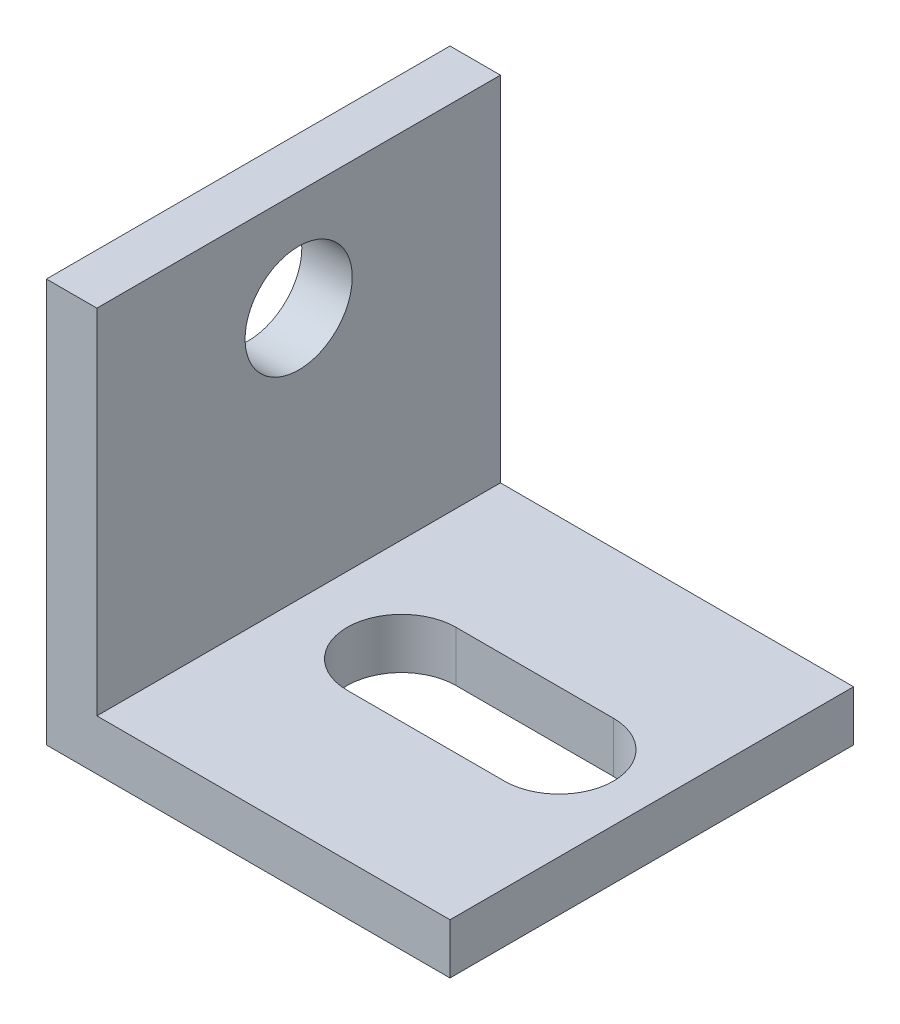
ISO-10303-21;
HEADER;
FILE_DESCRIPTION(('STEP AP214'),'2;1');
FILE_NAME('part.step','',(''),(''),'','','');
FILE_SCHEMA(('AUTOMOTIVE_DESIGN { 1 0 10303 214 1 1 1 1 }'));
ENDSEC;
DATA;
#1=APPLICATION_CONTEXT('core data for automotive mechanical design processes');
#2=APPLICATION_PROTOCOL_DEFINITION('international standard','automotive_design',2000,#1);
#3=PRODUCT_CONTEXT('',#1,'mechanical');
#4=PRODUCT('Part','Part','',(#3));
#5=PRODUCT_RELATED_PRODUCT_CATEGORY('part','',(#4));
#6=PRODUCT_DEFINITION_FORMATION('','',#4);
#7=PRODUCT_DEFINITION_CONTEXT('part definition',#1,'design');
#8=PRODUCT_DEFINITION('design','',#6,#7);
#9=PRODUCT_DEFINITION_SHAPE('','',#8);
#10=(LENGTH_UNIT() NAMED_UNIT(*) SI_UNIT(.MILLI.,.METRE.));
#11=(NAMED_UNIT(*) PLANE_ANGLE_UNIT() SI_UNIT($,.RADIAN.));
#12=(NAMED_UNIT(*) SI_UNIT($,.STERADIAN.) SOLID_ANGLE_UNIT());
#13=UNCERTAINTY_MEASURE_WITH_UNIT(LENGTH_MEASURE(1.E-05),#10,'distance_accuracy_value','');
#14=(GEOMETRIC_REPRESENTATION_CONTEXT(3) GLOBAL_UNCERTAINTY_ASSIGNED_CONTEXT((#13)) GLOBAL_UNIT_ASSIGNED_CONTEXT((#10,
#11,#12)) REPRESENTATION_CONTEXT('',''));
#15=CARTESIAN_POINT('',(0.,0.,0.));
#16=DIRECTION('',(0.,0.,1.));
#17=DIRECTION('',(1.,0.,0.));
#18=AXIS2_PLACEMENT_3D('',#15,#16,#17);
#19=CARTESIAN_POINT('',(0.,0.,25.4));
#20=DIRECTION('',(0.,1.,0.));
#21=DIRECTION('',(0.,0.,1.));
#22=AXIS2_PLACEMENT_3D('',#19,#20,#21);
#23=PLANE('',#22);
#24=DIRECTION('',(-1.,0.,0.));
#25=VECTOR('',#24,1.);
#26=CARTESIAN_POINT('',(0.,0.,9.271));
#27=LINE('',#26,#25);
#28=CARTESIAN_POINT('',(19.558,0.,9.271));
#29=VERTEX_POINT('',#28);
#30=CARTESIAN_POINT('',(9.652,0.,9.271));
#31=VERTEX_POINT('',#30);
#32=EDGE_CURVE('E144',#29,#31,#27,.T.);
#33=ORIENTED_EDGE('',*,*,#32,.T.);
#34=CARTESIAN_POINT('',(9.652,0.,12.7));
#35=DIRECTION('',(0.,1.,0.));
#36=DIRECTION('',(0.,0.,1.));
#37=AXIS2_PLACEMENT_3D('',#34,#35,#36);
#38=CIRCLE('',#37,3.429);
#39=CARTESIAN_POINT('',(9.652,0.,16.129));
#40=VERTEX_POINT('',#39);
#41=EDGE_CURVE('E147',#31,#40,#38,.T.);
#42=ORIENTED_EDGE('',*,*,#41,.T.);
#43=DIRECTION('',(1.,0.,0.));
#44=VECTOR('',#43,1.);
#45=CARTESIAN_POINT('',(0.,0.,16.129));
#46=LINE('',#45,#44);
#47=CARTESIAN_POINT('',(19.558,0.,16.129));
#48=VERTEX_POINT('',#47);
#49=EDGE_CURVE('E139',#40,#48,#46,.T.);
#50=ORIENTED_EDGE('',*,*,#49,.T.);
#51=CARTESIAN_POINT('',(19.558,0.,12.7));
#52=DIRECTION('',(0.,1.,0.));
#53=DIRECTION('',(0.,0.,1.));
#54=AXIS2_PLACEMENT_3D('',#51,#52,#53);
#55=CIRCLE('',#54,3.429);
#56=EDGE_CURVE('E119',#48,#29,#55,.T.);
#57=ORIENTED_EDGE('',*,*,#56,.T.);
#58=EDGE_LOOP('',(#33,#42,#50,#57));
#59=FACE_BOUND('',#58,.T.);
#60=DIRECTION('',(1.,0.,0.));
#61=VECTOR('',#60,1.);
#62=CARTESIAN_POINT('',(0.,0.,0.));
#63=LINE('',#62,#61);
#64=CARTESIAN_POINT('',(0.,0.,0.));
#65=VERTEX_POINT('',#64);
#66=CARTESIAN_POINT('',(25.4,0.,0.));
#67=VERTEX_POINT('',#66);
#68=EDGE_CURVE('E150',#65,#67,#63,.T.);
#69=ORIENTED_EDGE('',*,*,#68,.T.);
#70=DIRECTION('',(0.,0.,-1.));
#71=VECTOR('',#70,1.);
#72=CARTESIAN_POINT('',(25.4,0.,25.4));
#73=LINE('',#72,#71);
#74=CARTESIAN_POINT('',(25.4,0.,25.4));
#75=VERTEX_POINT('',#74);
#76=EDGE_CURVE('E11',#75,#67,#73,.T.);
#77=ORIENTED_EDGE('',*,*,#76,.F.);
#78=DIRECTION('',(1.,0.,0.));
#79=VECTOR('',#78,1.);
#80=CARTESIAN_POINT('',(0.,0.,25.4));
#81=LINE('',#80,#79);
#82=CARTESIAN_POINT('',(0.,0.,25.4));
#83=VERTEX_POINT('',#82);
#84=EDGE_CURVE('E151',#83,#75,#81,.T.);
#85=ORIENTED_EDGE('',*,*,#84,.F.);
#86=DIRECTION('',(0.,0.,-1.));
#87=VECTOR('',#86,1.);
#88=CARTESIAN_POINT('',(0.,0.,25.4));
#89=LINE('',#88,#87);
#90=EDGE_CURVE('E165',#83,#65,#89,.T.);
#91=ORIENTED_EDGE('',*,*,#90,.T.);
#92=EDGE_LOOP('',(#69,#77,#85,#91));
#93=FACE_BOUND('',#92,.T.);
#94=ADVANCED_FACE('F36',(#59,#93),#23,.F.);
#95=CARTESIAN_POINT('',(25.4,3.175,25.4));
#96=DIRECTION('',(-1.,0.,0.));
#97=DIRECTION('',(0.,0.,1.));
#98=AXIS2_PLACEMENT_3D('',#95,#96,#97);
#99=PLANE('',#98);
#100=DIRECTION('',(0.,1.,0.));
#101=VECTOR('',#100,1.);
#102=CARTESIAN_POINT('',(25.4,3.175,0.));
#103=LINE('',#102,#101);
#104=CARTESIAN_POINT('',(25.4,3.175,0.));
#105=VERTEX_POINT('',#104);
#106=EDGE_CURVE('E168',#67,#105,#103,.T.);
#107=ORIENTED_EDGE('',*,*,#106,.T.);
#108=DIRECTION('',(0.,0.,-1.));
#109=VECTOR('',#108,1.);
#110=CARTESIAN_POINT('',(25.4,3.175,25.4));
#111=LINE('',#110,#109);
#112=CARTESIAN_POINT('',(25.4,3.175,25.4));
#113=VERTEX_POINT('',#112);
#114=EDGE_CURVE('E44',#113,#105,#111,.T.);
#115=ORIENTED_EDGE('',*,*,#114,.F.);
#116=DIRECTION('',(0.,1.,0.));
#117=VECTOR('',#116,1.);
#118=CARTESIAN_POINT('',(25.4,3.175,25.4));
#119=LINE('',#118,#117);
#120=EDGE_CURVE('E154',#75,#113,#119,.T.);
#121=ORIENTED_EDGE('',*,*,#120,.F.);
#122=ORIENTED_EDGE('',*,*,#76,.T.);
#123=EDGE_LOOP('',(#107,#115,#121,#122));
#124=FACE_BOUND('',#123,.T.);
#125=ADVANCED_FACE('F214',(#124),#99,.F.);
#126=CARTESIAN_POINT('',(3.175,3.175,25.4));
#127=DIRECTION('',(0.,-1.,0.));
#128=DIRECTION('',(0.,0.,-1.));
#129=AXIS2_PLACEMENT_3D('',#126,#127,#128);
#130=PLANE('',#129);
#131=DIRECTION('',(1.,0.,0.));
#132=VECTOR('',#131,1.);
#133=CARTESIAN_POINT('',(9.652,3.175,16.129));
#134=LINE('',#133,#132);
#135=CARTESIAN_POINT('',(9.652,3.175,16.129));
#136=VERTEX_POINT('',#135);
#137=CARTESIAN_POINT('',(19.558,3.175,16.129));
#138=VERTEX_POINT('',#137);
#139=EDGE_CURVE('E125',#136,#138,#134,.T.);
#140=ORIENTED_EDGE('',*,*,#139,.F.);
#141=CARTESIAN_POINT('',(9.652,3.175,12.7));
#142=DIRECTION('',(0.,1.,0.));
#143=DIRECTION('',(0.,0.,1.));
#144=AXIS2_PLACEMENT_3D('',#141,#142,#143);
#145=CIRCLE('',#144,3.429);
#146=CARTESIAN_POINT('',(9.652,3.175,9.271));
#147=VERTEX_POINT('',#146);
#148=EDGE_CURVE('E59',#147,#136,#145,.T.);
#149=ORIENTED_EDGE('',*,*,#148,.F.);
#150=DIRECTION('',(-1.,0.,0.));
#151=VECTOR('',#150,1.);
#152=CARTESIAN_POINT('',(9.652,3.175,9.271));
#153=LINE('',#152,#151);
#154=CARTESIAN_POINT('',(19.558,3.175,9.271));
#155=VERTEX_POINT('',#154);
#156=EDGE_CURVE('E132',#155,#147,#153,.T.);
#157=ORIENTED_EDGE('',*,*,#156,.F.);
#158=CARTESIAN_POINT('',(19.558,3.175,12.7));
#159=DIRECTION('',(0.,1.,0.));
#160=DIRECTION('',(0.,0.,1.));
#161=AXIS2_PLACEMENT_3D('',#158,#159,#160);
#162=CIRCLE('',#161,3.429);
#163=EDGE_CURVE('E116',#138,#155,#162,.T.);
#164=ORIENTED_EDGE('',*,*,#163,.F.);
#165=EDGE_LOOP('',(#140,#149,#157,#164));
#166=FACE_BOUND('',#165,.T.);
#167=DIRECTION('',(-1.,0.,0.));
#168=VECTOR('',#167,1.);
#169=CARTESIAN_POINT('',(3.175,3.175,0.));
#170=LINE('',#169,#168);
#171=CARTESIAN_POINT('',(3.175,3.175,0.));
#172=VERTEX_POINT('',#171);
#173=EDGE_CURVE('E170',#105,#172,#170,.T.);
#174=ORIENTED_EDGE('',*,*,#173,.T.);
#175=DIRECTION('',(0.,0.,-1.));
#176=VECTOR('',#175,1.);
#177=CARTESIAN_POINT('',(3.175,3.175,25.4));
#178=LINE('',#177,#176);
#179=CARTESIAN_POINT('',(3.175,3.175,25.4));
#180=VERTEX_POINT('',#179);
#181=EDGE_CURVE('E185',#180,#172,#178,.T.);
#182=ORIENTED_EDGE('',*,*,#181,.F.);
#183=DIRECTION('',(-1.,0.,0.));
#184=VECTOR('',#183,1.);
#185=CARTESIAN_POINT('',(3.175,3.175,25.4));
#186=LINE('',#185,#184);
#187=EDGE_CURVE('E157',#113,#180,#186,.T.);
#188=ORIENTED_EDGE('',*,*,#187,.F.);
#189=ORIENTED_EDGE('',*,*,#114,.T.);
#190=EDGE_LOOP('',(#174,#182,#188,#189));
#191=FACE_BOUND('',#190,.T.);
#192=ADVANCED_FACE('F129',(#166,#191),#130,.F.);
#193=CARTESIAN_POINT('',(3.175,25.4,25.4));
#194=DIRECTION('',(-1.,0.,0.));
#195=DIRECTION('',(0.,-1.,0.));
#196=AXIS2_PLACEMENT_3D('',#193,#194,#195);
#197=PLANE('',#196);
#198=CARTESIAN_POINT('',(3.175,19.05,12.7));
#199=DIRECTION('',(1.,0.,0.));
#200=DIRECTION('',(0.,1.,0.));
#201=AXIS2_PLACEMENT_3D('',#198,#199,#200);
#202=CIRCLE('',#201,3.3734375);
#203=CARTESIAN_POINT('',(3.175,22.4234375,12.7));
#204=VERTEX_POINT('',#203);
#205=EDGE_CURVE('E258',#204,#204,#202,.T.);
#206=ORIENTED_EDGE('',*,*,#205,.F.);
#207=EDGE_LOOP('',(#206));
#208=FACE_BOUND('',#207,.T.);
#209=DIRECTION('',(0.,1.,0.));
#210=VECTOR('',#209,1.);
#211=CARTESIAN_POINT('',(3.175,25.4,0.));
#212=LINE('',#211,#210);
#213=CARTESIAN_POINT('',(3.175,25.4,0.));
#214=VERTEX_POINT('',#213);
#215=EDGE_CURVE('E172',#172,#214,#212,.T.);
#216=ORIENTED_EDGE('',*,*,#215,.T.);
#217=DIRECTION('',(0.,0.,-1.));
#218=VECTOR('',#217,1.);
#219=CARTESIAN_POINT('',(3.175,25.4,25.4));
#220=LINE('',#219,#218);
#221=CARTESIAN_POINT('',(3.175,25.4,25.4));
#222=VERTEX_POINT('',#221);
#223=EDGE_CURVE('E182',#222,#214,#220,.T.);
#224=ORIENTED_EDGE('',*,*,#223,.F.);
#225=DIRECTION('',(0.,1.,0.));
#226=VECTOR('',#225,1.);
#227=CARTESIAN_POINT('',(3.175,25.4,25.4));
#228=LINE('',#227,#226);
#229=EDGE_CURVE('E159',#180,#222,#228,.T.);
#230=ORIENTED_EDGE('',*,*,#229,.F.);
#231=ORIENTED_EDGE('',*,*,#181,.T.);
#232=EDGE_LOOP('',(#216,#224,#230,#231));
#233=FACE_BOUND('',#232,.T.);
#234=ADVANCED_FACE('F202',(#208,#233),#197,.F.);
#235=CARTESIAN_POINT('',(0.,25.4,25.4));
#236=DIRECTION('',(0.,-1.,0.));
#237=DIRECTION('',(0.,0.,-1.));
#238=AXIS2_PLACEMENT_3D('',#235,#236,#237);
#239=PLANE('',#238);
#240=DIRECTION('',(-1.,0.,0.));
#241=VECTOR('',#240,1.);
#242=CARTESIAN_POINT('',(0.,25.4,0.));
#243=LINE('',#242,#241);
#244=CARTESIAN_POINT('',(0.,25.4,0.));
#245=VERTEX_POINT('',#244);
#246=EDGE_CURVE('E174',#214,#245,#243,.T.);
#247=ORIENTED_EDGE('',*,*,#246,.T.);
#248=DIRECTION('',(0.,0.,-1.));
#249=VECTOR('',#248,1.);
#250=CARTESIAN_POINT('',(0.,25.4,25.4));
#251=LINE('',#250,#249);
#252=CARTESIAN_POINT('',(0.,25.4,25.4));
#253=VERTEX_POINT('',#252);
#254=EDGE_CURVE('E179',#253,#245,#251,.T.);
#255=ORIENTED_EDGE('',*,*,#254,.F.);
#256=DIRECTION('',(-1.,0.,0.));
#257=VECTOR('',#256,1.);
#258=CARTESIAN_POINT('',(0.,25.4,25.4));
#259=LINE('',#258,#257);
#260=EDGE_CURVE('E161',#222,#253,#259,.T.);
#261=ORIENTED_EDGE('',*,*,#260,.F.);
#262=ORIENTED_EDGE('',*,*,#223,.T.);
#263=EDGE_LOOP('',(#247,#255,#261,#262));
#264=FACE_BOUND('',#263,.T.);
#265=ADVANCED_FACE('F206',(#264),#239,.F.);
#266=CARTESIAN_POINT('',(0.,0.,25.4));
#267=DIRECTION('',(1.,0.,0.));
#268=DIRECTION('',(0.,0.,-1.));
#269=AXIS2_PLACEMENT_3D('',#266,#267,#268);
#270=PLANE('',#269);
#271=CARTESIAN_POINT('',(0.,19.05,12.7));
#272=DIRECTION('',(1.,0.,0.));
#273=DIRECTION('',(0.,0.,-1.));
#274=AXIS2_PLACEMENT_3D('',#271,#272,#273);
#275=CIRCLE('',#274,3.3734375);
#276=CARTESIAN_POINT('',(0.,19.05,9.3265625));
#277=VERTEX_POINT('',#276);
#278=EDGE_CURVE('E39',#277,#277,#275,.T.);
#279=ORIENTED_EDGE('',*,*,#278,.T.);
#280=EDGE_LOOP('',(#279));
#281=FACE_BOUND('',#280,.T.);
#282=DIRECTION('',(0.,-1.,0.));
#283=VECTOR('',#282,1.);
#284=CARTESIAN_POINT('',(0.,0.,0.));
#285=LINE('',#284,#283);
#286=EDGE_CURVE('E155',#245,#65,#285,.T.);
#287=ORIENTED_EDGE('',*,*,#286,.T.);
#288=ORIENTED_EDGE('',*,*,#90,.F.);
#289=DIRECTION('',(0.,-1.,0.));
#290=VECTOR('',#289,1.);
#291=CARTESIAN_POINT('',(0.,0.,25.4));
#292=LINE('',#291,#290);
#293=EDGE_CURVE('E163',#253,#83,#292,.T.);
#294=ORIENTED_EDGE('',*,*,#293,.F.);
#295=ORIENTED_EDGE('',*,*,#254,.T.);
#296=EDGE_LOOP('',(#287,#288,#294,#295));
#297=FACE_BOUND('',#296,.T.);
#298=ADVANCED_FACE('F217',(#281,#297),#270,.F.);
#299=CARTESIAN_POINT('',(0.,0.,25.4));
#300=DIRECTION('',(0.,0.,-1.));
#301=DIRECTION('',(-1.,0.,0.));
#302=AXIS2_PLACEMENT_3D('',#299,#300,#301);
#303=PLANE('',#302);
#304=ORIENTED_EDGE('',*,*,#84,.T.);
#305=ORIENTED_EDGE('',*,*,#120,.T.);
#306=ORIENTED_EDGE('',*,*,#187,.T.);
#307=ORIENTED_EDGE('',*,*,#229,.T.);
#308=ORIENTED_EDGE('',*,*,#260,.T.);
#309=ORIENTED_EDGE('',*,*,#293,.T.);
#310=EDGE_LOOP('',(#304,#305,#306,#307,#308,#309));
#311=FACE_BOUND('',#310,.T.);
#312=ADVANCED_FACE('F210',(#311),#303,.F.);
#313=CARTESIAN_POINT('',(0.,0.,0.));
#314=DIRECTION('',(0.,0.,-1.));
#315=DIRECTION('',(-1.,0.,0.));
#316=AXIS2_PLACEMENT_3D('',#313,#314,#315);
#317=PLANE('',#316);
#318=ORIENTED_EDGE('',*,*,#68,.F.);
#319=ORIENTED_EDGE('',*,*,#286,.F.);
#320=ORIENTED_EDGE('',*,*,#246,.F.);
#321=ORIENTED_EDGE('',*,*,#215,.F.);
#322=ORIENTED_EDGE('',*,*,#173,.F.);
#323=ORIENTED_EDGE('',*,*,#106,.F.);
#324=EDGE_LOOP('',(#318,#319,#320,#321,#322,#323));
#325=FACE_BOUND('',#324,.T.);
#326=ADVANCED_FACE('F197',(#325),#317,.T.);
#327=CARTESIAN_POINT('',(9.652,-22.225,12.7));
#328=DIRECTION('',(0.,1.,0.));
#329=DIRECTION('',(0.,0.,1.));
#330=AXIS2_PLACEMENT_3D('',#327,#328,#329);
#331=CYLINDRICAL_SURFACE('',#330,3.429);
#332=DIRECTION('',(0.,1.,0.));
#333=VECTOR('',#332,1.);
#334=CARTESIAN_POINT('',(9.652,-22.225,9.271));
#335=LINE('',#334,#333);
#336=EDGE_CURVE('E137',#31,#147,#335,.T.);
#337=ORIENTED_EDGE('',*,*,#336,.T.);
#338=ORIENTED_EDGE('',*,*,#148,.T.);
#339=DIRECTION('',(0.,1.,0.));
#340=VECTOR('',#339,1.);
#341=CARTESIAN_POINT('',(9.652,-22.225,16.129));
#342=LINE('',#341,#340);
#343=EDGE_CURVE('E122',#40,#136,#342,.T.);
#344=ORIENTED_EDGE('',*,*,#343,.F.);
#345=ORIENTED_EDGE('',*,*,#41,.F.);
#346=EDGE_LOOP('',(#337,#338,#344,#345));
#347=FACE_BOUND('',#346,.T.);
#348=ADVANCED_FACE('F237',(#347),#331,.F.);
#349=CARTESIAN_POINT('',(9.652,-22.225,9.271));
#350=DIRECTION('',(0.,0.,-1.));
#351=DIRECTION('',(-1.,0.,0.));
#352=AXIS2_PLACEMENT_3D('',#349,#350,#351);
#353=PLANE('',#352);
#354=DIRECTION('',(0.,1.,0.));
#355=VECTOR('',#354,1.);
#356=CARTESIAN_POINT('',(19.558,-22.225,9.271));
#357=LINE('',#356,#355);
#358=EDGE_CURVE('E121',#29,#155,#357,.T.);
#359=ORIENTED_EDGE('',*,*,#358,.T.);
#360=ORIENTED_EDGE('',*,*,#156,.T.);
#361=ORIENTED_EDGE('',*,*,#336,.F.);
#362=ORIENTED_EDGE('',*,*,#32,.F.);
#363=EDGE_LOOP('',(#359,#360,#361,#362));
#364=FACE_BOUND('',#363,.T.);
#365=ADVANCED_FACE('F236',(#364),#353,.F.);
#366=CARTESIAN_POINT('',(19.558,-22.225,12.7));
#367=DIRECTION('',(0.,1.,0.));
#368=DIRECTION('',(0.,0.,1.));
#369=AXIS2_PLACEMENT_3D('',#366,#367,#368);
#370=CYLINDRICAL_SURFACE('',#369,3.429);
#371=DIRECTION('',(0.,1.,0.));
#372=VECTOR('',#371,1.);
#373=CARTESIAN_POINT('',(19.558,-22.225,16.129));
#374=LINE('',#373,#372);
#375=EDGE_CURVE('E51',#48,#138,#374,.T.);
#376=ORIENTED_EDGE('',*,*,#375,.T.);
#377=ORIENTED_EDGE('',*,*,#163,.T.);
#378=ORIENTED_EDGE('',*,*,#358,.F.);
#379=ORIENTED_EDGE('',*,*,#56,.F.);
#380=EDGE_LOOP('',(#376,#377,#378,#379));
#381=FACE_BOUND('',#380,.T.);
#382=ADVANCED_FACE('F113',(#381),#370,.F.);
#383=CARTESIAN_POINT('',(9.652,-22.225,16.129));
#384=DIRECTION('',(0.,0.,1.));
#385=DIRECTION('',(1.,0.,0.));
#386=AXIS2_PLACEMENT_3D('',#383,#384,#385);
#387=PLANE('',#386);
#388=ORIENTED_EDGE('',*,*,#343,.T.);
#389=ORIENTED_EDGE('',*,*,#139,.T.);
#390=ORIENTED_EDGE('',*,*,#375,.F.);
#391=ORIENTED_EDGE('',*,*,#49,.F.);
#392=EDGE_LOOP('',(#388,#389,#390,#391));
#393=FACE_BOUND('',#392,.T.);
#394=ADVANCED_FACE('F126',(#393),#387,.F.);
#395=CARTESIAN_POINT('',(-22.225,19.05,12.7));
#396=DIRECTION('',(1.,0.,0.));
#397=DIRECTION('',(0.,1.,0.));
#398=AXIS2_PLACEMENT_3D('',#395,#396,#397);
#399=CYLINDRICAL_SURFACE('',#398,3.3734375);
#400=ORIENTED_EDGE('',*,*,#205,.T.);
#401=EDGE_LOOP('',(#400));
#402=FACE_BOUND('',#401,.T.);
#403=ORIENTED_EDGE('',*,*,#278,.F.);
#404=EDGE_LOOP('',(#403));
#405=FACE_BOUND('',#404,.T.);
#406=ADVANCED_FACE('F248',(#402,#405),#399,.F.);
#407=CLOSED_SHELL('',(#94,#125,#192,#234,#265,#298,#312,#326,#348,#365,#382,#394,#406));
#408=MANIFOLD_SOLID_BREP('B2',#407);
#409=ADVANCED_BREP_SHAPE_REPRESENTATION('',(#18,#408),#14);
#410=SHAPE_DEFINITION_REPRESENTATION(#9,#409);
ENDSEC;
END-ISO-10303-21;
